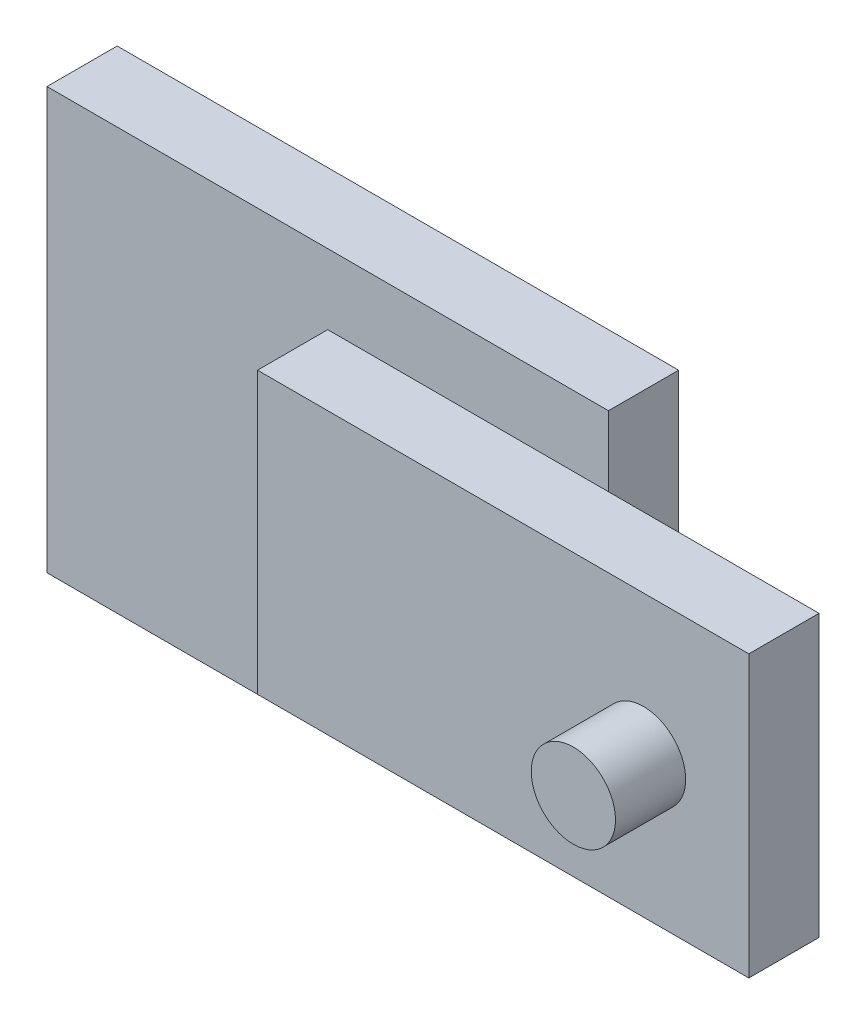
ISO-10303-21;
HEADER;
FILE_DESCRIPTION(('STEP AP214'),'2;1');
FILE_NAME('part.step','',(''),(''),'','','');
FILE_SCHEMA(('AUTOMOTIVE_DESIGN { 1 0 10303 214 1 1 1 1 }'));
ENDSEC;
DATA;
#1=APPLICATION_CONTEXT('core data for automotive mechanical design processes');
#2=APPLICATION_PROTOCOL_DEFINITION('international standard','automotive_design',2000,#1);
#3=PRODUCT_CONTEXT('',#1,'mechanical');
#4=PRODUCT('Part','Part','',(#3));
#5=PRODUCT_RELATED_PRODUCT_CATEGORY('part','',(#4));
#6=PRODUCT_DEFINITION_FORMATION('','',#4);
#7=PRODUCT_DEFINITION_CONTEXT('part definition',#1,'design');
#8=PRODUCT_DEFINITION('design','',#6,#7);
#9=PRODUCT_DEFINITION_SHAPE('','',#8);
#10=(LENGTH_UNIT() NAMED_UNIT(*) SI_UNIT(.MILLI.,.METRE.));
#11=(NAMED_UNIT(*) PLANE_ANGLE_UNIT() SI_UNIT($,.RADIAN.));
#12=(NAMED_UNIT(*) SI_UNIT($,.STERADIAN.) SOLID_ANGLE_UNIT());
#13=UNCERTAINTY_MEASURE_WITH_UNIT(LENGTH_MEASURE(1.E-05),#10,'distance_accuracy_value','');
#14=(GEOMETRIC_REPRESENTATION_CONTEXT(3) GLOBAL_UNCERTAINTY_ASSIGNED_CONTEXT((#13)) GLOBAL_UNIT_ASSIGNED_CONTEXT((#10,
#11,#12)) REPRESENTATION_CONTEXT('',''));
#15=CARTESIAN_POINT('',(0.,0.,0.));
#16=DIRECTION('',(0.,0.,1.));
#17=DIRECTION('',(1.,0.,0.));
#18=AXIS2_PLACEMENT_3D('',#15,#16,#17);
#19=CARTESIAN_POINT('',(0.,0.,10.));
#20=DIRECTION('',(0.,0.,-1.));
#21=DIRECTION('',(-1.,0.,0.));
#22=AXIS2_PLACEMENT_3D('',#19,#20,#21);
#23=PLANE('',#22);
#24=DIRECTION('',(-1.,0.,0.));
#25=VECTOR('',#24,1.);
#26=CARTESIAN_POINT('',(0.,20.,10.));
#27=LINE('',#26,#25);
#28=CARTESIAN_POINT('',(40.,20.,10.));
#29=VERTEX_POINT('',#28);
#30=CARTESIAN_POINT('',(0.,20.,10.));
#31=VERTEX_POINT('',#30);
#32=EDGE_CURVE('E40',#29,#31,#27,.T.);
#33=ORIENTED_EDGE('',*,*,#32,.F.);
#34=DIRECTION('',(0.,1.,0.));
#35=VECTOR('',#34,1.);
#36=CARTESIAN_POINT('',(40.,-30.,10.));
#37=LINE('',#36,#35);
#38=CARTESIAN_POINT('',(40.,30.,10.));
#39=VERTEX_POINT('',#38);
#40=EDGE_CURVE('E137',#29,#39,#37,.T.);
#41=ORIENTED_EDGE('',*,*,#40,.T.);
#42=DIRECTION('',(-1.,0.,0.));
#43=VECTOR('',#42,1.);
#44=CARTESIAN_POINT('',(-40.,30.,10.));
#45=LINE('',#44,#43);
#46=CARTESIAN_POINT('',(-40.,30.,10.));
#47=VERTEX_POINT('',#46);
#48=EDGE_CURVE('E135',#39,#47,#45,.T.);
#49=ORIENTED_EDGE('',*,*,#48,.T.);
#50=DIRECTION('',(0.,-1.,0.));
#51=VECTOR('',#50,1.);
#52=CARTESIAN_POINT('',(-40.,-30.,10.));
#53=LINE('',#52,#51);
#54=CARTESIAN_POINT('',(-40.,-30.,10.));
#55=VERTEX_POINT('',#54);
#56=EDGE_CURVE('E139',#47,#55,#53,.T.);
#57=ORIENTED_EDGE('',*,*,#56,.T.);
#58=DIRECTION('',(1.,0.,0.));
#59=VECTOR('',#58,1.);
#60=CARTESIAN_POINT('',(-40.,-30.,10.));
#61=LINE('',#60,#59);
#62=CARTESIAN_POINT('',(40.,-30.,10.));
#63=VERTEX_POINT('',#62);
#64=EDGE_CURVE('E141',#55,#63,#61,.T.);
#65=ORIENTED_EDGE('',*,*,#64,.T.);
#66=CARTESIAN_POINT('',(40.,-20.,10.));
#67=VERTEX_POINT('',#66);
#68=EDGE_CURVE('E132',#63,#67,#37,.T.);
#69=ORIENTED_EDGE('',*,*,#68,.T.);
#70=DIRECTION('',(1.,0.,0.));
#71=VECTOR('',#70,1.);
#72=CARTESIAN_POINT('',(0.,-20.,10.));
#73=LINE('',#72,#71);
#74=CARTESIAN_POINT('',(0.,-20.,10.));
#75=VERTEX_POINT('',#74);
#76=EDGE_CURVE('E178',#75,#67,#73,.T.);
#77=ORIENTED_EDGE('',*,*,#76,.F.);
#78=DIRECTION('',(0.,-1.,0.));
#79=VECTOR('',#78,1.);
#80=CARTESIAN_POINT('',(0.,-20.,10.));
#81=LINE('',#80,#79);
#82=EDGE_CURVE('E47',#31,#75,#81,.T.);
#83=ORIENTED_EDGE('',*,*,#82,.F.);
#84=EDGE_LOOP('',(#33,#41,#49,#57,#65,#69,#77,#83));
#85=FACE_BOUND('',#84,.T.);
#86=ADVANCED_FACE('F32',(#85),#23,.F.);
#87=CARTESIAN_POINT('',(40.,-30.,10.));
#88=DIRECTION('',(-1.,0.,0.));
#89=DIRECTION('',(0.,0.,1.));
#90=AXIS2_PLACEMENT_3D('',#87,#88,#89);
#91=PLANE('',#90);
#92=DIRECTION('',(0.,1.,0.));
#93=VECTOR('',#92,1.);
#94=CARTESIAN_POINT('',(40.,-30.,0.));
#95=LINE('',#94,#93);
#96=CARTESIAN_POINT('',(40.,-30.,0.));
#97=VERTEX_POINT('',#96);
#98=CARTESIAN_POINT('',(40.,30.,0.));
#99=VERTEX_POINT('',#98);
#100=EDGE_CURVE('E123',#97,#99,#95,.T.);
#101=ORIENTED_EDGE('',*,*,#100,.T.);
#102=DIRECTION('',(0.,0.,-1.));
#103=VECTOR('',#102,1.);
#104=CARTESIAN_POINT('',(40.,30.,10.));
#105=LINE('',#104,#103);
#106=EDGE_CURVE('E156',#39,#99,#105,.T.);
#107=ORIENTED_EDGE('',*,*,#106,.F.);
#108=ORIENTED_EDGE('',*,*,#40,.F.);
#109=EDGE_CURVE('E136',#67,#29,#37,.T.);
#110=ORIENTED_EDGE('',*,*,#109,.F.);
#111=ORIENTED_EDGE('',*,*,#68,.F.);
#112=DIRECTION('',(0.,0.,-1.));
#113=VECTOR('',#112,1.);
#114=CARTESIAN_POINT('',(40.,-30.,10.));
#115=LINE('',#114,#113);
#116=EDGE_CURVE('E142',#63,#97,#115,.T.);
#117=ORIENTED_EDGE('',*,*,#116,.T.);
#118=EDGE_LOOP('',(#101,#107,#108,#110,#111,#117));
#119=FACE_BOUND('',#118,.T.);
#120=ADVANCED_FACE('F34',(#119),#91,.F.);
#121=CARTESIAN_POINT('',(-40.,30.,10.));
#122=DIRECTION('',(0.,-1.,0.));
#123=DIRECTION('',(0.,0.,-1.));
#124=AXIS2_PLACEMENT_3D('',#121,#122,#123);
#125=PLANE('',#124);
#126=DIRECTION('',(-1.,0.,0.));
#127=VECTOR('',#126,1.);
#128=CARTESIAN_POINT('',(-40.,30.,0.));
#129=LINE('',#128,#127);
#130=CARTESIAN_POINT('',(-40.,30.,0.));
#131=VERTEX_POINT('',#130);
#132=EDGE_CURVE('E126',#99,#131,#129,.T.);
#133=ORIENTED_EDGE('',*,*,#132,.T.);
#134=DIRECTION('',(0.,0.,-1.));
#135=VECTOR('',#134,1.);
#136=CARTESIAN_POINT('',(-40.,30.,10.));
#137=LINE('',#136,#135);
#138=EDGE_CURVE('E154',#47,#131,#137,.T.);
#139=ORIENTED_EDGE('',*,*,#138,.F.);
#140=ORIENTED_EDGE('',*,*,#48,.F.);
#141=ORIENTED_EDGE('',*,*,#106,.T.);
#142=EDGE_LOOP('',(#133,#139,#140,#141));
#143=FACE_BOUND('',#142,.T.);
#144=ADVANCED_FACE('F193',(#143),#125,.F.);
#145=CARTESIAN_POINT('',(-40.,-30.,10.));
#146=DIRECTION('',(1.,0.,0.));
#147=DIRECTION('',(0.,0.,-1.));
#148=AXIS2_PLACEMENT_3D('',#145,#146,#147);
#149=PLANE('',#148);
#150=DIRECTION('',(0.,-1.,0.));
#151=VECTOR('',#150,1.);
#152=CARTESIAN_POINT('',(-40.,-30.,0.));
#153=LINE('',#152,#151);
#154=CARTESIAN_POINT('',(-40.,-30.,0.));
#155=VERTEX_POINT('',#154);
#156=EDGE_CURVE('E145',#131,#155,#153,.T.);
#157=ORIENTED_EDGE('',*,*,#156,.T.);
#158=DIRECTION('',(0.,0.,-1.));
#159=VECTOR('',#158,1.);
#160=CARTESIAN_POINT('',(-40.,-30.,10.));
#161=LINE('',#160,#159);
#162=EDGE_CURVE('E151',#55,#155,#161,.T.);
#163=ORIENTED_EDGE('',*,*,#162,.F.);
#164=ORIENTED_EDGE('',*,*,#56,.F.);
#165=ORIENTED_EDGE('',*,*,#138,.T.);
#166=EDGE_LOOP('',(#157,#163,#164,#165));
#167=FACE_BOUND('',#166,.T.);
#168=ADVANCED_FACE('F202',(#167),#149,.F.);
#169=CARTESIAN_POINT('',(-40.,-30.,10.));
#170=DIRECTION('',(0.,1.,0.));
#171=DIRECTION('',(0.,0.,1.));
#172=AXIS2_PLACEMENT_3D('',#169,#170,#171);
#173=PLANE('',#172);
#174=DIRECTION('',(1.,0.,0.));
#175=VECTOR('',#174,1.);
#176=CARTESIAN_POINT('',(-40.,-30.,0.));
#177=LINE('',#176,#175);
#178=EDGE_CURVE('E147',#155,#97,#177,.T.);
#179=ORIENTED_EDGE('',*,*,#178,.T.);
#180=ORIENTED_EDGE('',*,*,#116,.F.);
#181=ORIENTED_EDGE('',*,*,#64,.F.);
#182=ORIENTED_EDGE('',*,*,#162,.T.);
#183=EDGE_LOOP('',(#179,#180,#181,#182));
#184=FACE_BOUND('',#183,.T.);
#185=ADVANCED_FACE('F206',(#184),#173,.F.);
#186=CARTESIAN_POINT('',(0.,0.,0.));
#187=DIRECTION('',(0.,0.,-1.));
#188=DIRECTION('',(-1.,0.,0.));
#189=AXIS2_PLACEMENT_3D('',#186,#187,#188);
#190=PLANE('',#189);
#191=ORIENTED_EDGE('',*,*,#100,.F.);
#192=ORIENTED_EDGE('',*,*,#178,.F.);
#193=ORIENTED_EDGE('',*,*,#156,.F.);
#194=ORIENTED_EDGE('',*,*,#132,.F.);
#195=EDGE_LOOP('',(#191,#192,#193,#194));
#196=FACE_BOUND('',#195,.T.);
#197=ADVANCED_FACE('F199',(#196),#190,.T.);
#198=CARTESIAN_POINT('',(0.,20.,20.));
#199=DIRECTION('',(0.,-1.,0.));
#200=DIRECTION('',(0.,0.,-1.));
#201=AXIS2_PLACEMENT_3D('',#198,#199,#200);
#202=PLANE('',#201);
#203=CARTESIAN_POINT('',(70.,20.,10.));
#204=VERTEX_POINT('',#203);
#205=EDGE_CURVE('E162',#204,#29,#27,.T.);
#206=ORIENTED_EDGE('',*,*,#205,.T.);
#207=ORIENTED_EDGE('',*,*,#32,.T.);
#208=DIRECTION('',(0.,0.,-1.));
#209=VECTOR('',#208,1.);
#210=CARTESIAN_POINT('',(0.,20.,20.));
#211=LINE('',#210,#209);
#212=CARTESIAN_POINT('',(0.,20.,20.));
#213=VERTEX_POINT('',#212);
#214=EDGE_CURVE('E104',#213,#31,#211,.T.);
#215=ORIENTED_EDGE('',*,*,#214,.F.);
#216=DIRECTION('',(-1.,0.,0.));
#217=VECTOR('',#216,1.);
#218=CARTESIAN_POINT('',(0.,20.,20.));
#219=LINE('',#218,#217);
#220=CARTESIAN_POINT('',(70.,20.,20.));
#221=VERTEX_POINT('',#220);
#222=EDGE_CURVE('E110',#221,#213,#219,.T.);
#223=ORIENTED_EDGE('',*,*,#222,.F.);
#224=DIRECTION('',(0.,0.,-1.));
#225=VECTOR('',#224,1.);
#226=CARTESIAN_POINT('',(70.,20.,20.));
#227=LINE('',#226,#225);
#228=EDGE_CURVE('E173',#221,#204,#227,.T.);
#229=ORIENTED_EDGE('',*,*,#228,.T.);
#230=EDGE_LOOP('',(#206,#207,#215,#223,#229));
#231=FACE_BOUND('',#230,.T.);
#232=ADVANCED_FACE('F122',(#231),#202,.F.);
#233=CARTESIAN_POINT('',(0.,-20.,20.));
#234=DIRECTION('',(1.,0.,0.));
#235=DIRECTION('',(0.,0.,-1.));
#236=AXIS2_PLACEMENT_3D('',#233,#234,#235);
#237=PLANE('',#236);
#238=ORIENTED_EDGE('',*,*,#82,.T.);
#239=DIRECTION('',(0.,0.,-1.));
#240=VECTOR('',#239,1.);
#241=CARTESIAN_POINT('',(0.,-20.,20.));
#242=LINE('',#241,#240);
#243=CARTESIAN_POINT('',(0.,-20.,20.));
#244=VERTEX_POINT('',#243);
#245=EDGE_CURVE('E106',#244,#75,#242,.T.);
#246=ORIENTED_EDGE('',*,*,#245,.F.);
#247=DIRECTION('',(0.,-1.,0.));
#248=VECTOR('',#247,1.);
#249=CARTESIAN_POINT('',(0.,-20.,20.));
#250=LINE('',#249,#248);
#251=EDGE_CURVE('E100',#213,#244,#250,.T.);
#252=ORIENTED_EDGE('',*,*,#251,.F.);
#253=ORIENTED_EDGE('',*,*,#214,.T.);
#254=EDGE_LOOP('',(#238,#246,#252,#253));
#255=FACE_BOUND('',#254,.T.);
#256=ADVANCED_FACE('F102',(#255),#237,.F.);
#257=CARTESIAN_POINT('',(0.,-20.,20.));
#258=DIRECTION('',(0.,1.,0.));
#259=DIRECTION('',(0.,0.,1.));
#260=AXIS2_PLACEMENT_3D('',#257,#258,#259);
#261=PLANE('',#260);
#262=ORIENTED_EDGE('',*,*,#76,.T.);
#263=CARTESIAN_POINT('',(70.,-20.,10.));
#264=VERTEX_POINT('',#263);
#265=EDGE_CURVE('E167',#67,#264,#73,.T.);
#266=ORIENTED_EDGE('',*,*,#265,.T.);
#267=DIRECTION('',(0.,0.,-1.));
#268=VECTOR('',#267,1.);
#269=CARTESIAN_POINT('',(70.,-20.,20.));
#270=LINE('',#269,#268);
#271=CARTESIAN_POINT('',(70.,-20.,20.));
#272=VERTEX_POINT('',#271);
#273=EDGE_CURVE('E128',#272,#264,#270,.T.);
#274=ORIENTED_EDGE('',*,*,#273,.F.);
#275=DIRECTION('',(1.,0.,0.));
#276=VECTOR('',#275,1.);
#277=CARTESIAN_POINT('',(0.,-20.,20.));
#278=LINE('',#277,#276);
#279=EDGE_CURVE('E109',#244,#272,#278,.T.);
#280=ORIENTED_EDGE('',*,*,#279,.F.);
#281=ORIENTED_EDGE('',*,*,#245,.T.);
#282=EDGE_LOOP('',(#262,#266,#274,#280,#281));
#283=FACE_BOUND('',#282,.T.);
#284=ADVANCED_FACE('F183',(#283),#261,.F.);
#285=CARTESIAN_POINT('',(70.,20.,20.));
#286=DIRECTION('',(-1.,0.,0.));
#287=DIRECTION('',(0.,0.,1.));
#288=AXIS2_PLACEMENT_3D('',#285,#286,#287);
#289=PLANE('',#288);
#290=DIRECTION('',(0.,1.,0.));
#291=VECTOR('',#290,1.);
#292=CARTESIAN_POINT('',(70.,20.,10.));
#293=LINE('',#292,#291);
#294=EDGE_CURVE('E119',#264,#204,#293,.T.);
#295=ORIENTED_EDGE('',*,*,#294,.T.);
#296=ORIENTED_EDGE('',*,*,#228,.F.);
#297=DIRECTION('',(0.,1.,0.));
#298=VECTOR('',#297,1.);
#299=CARTESIAN_POINT('',(70.,20.,20.));
#300=LINE('',#299,#298);
#301=EDGE_CURVE('E115',#272,#221,#300,.T.);
#302=ORIENTED_EDGE('',*,*,#301,.F.);
#303=ORIENTED_EDGE('',*,*,#273,.T.);
#304=EDGE_LOOP('',(#295,#296,#302,#303));
#305=FACE_BOUND('',#304,.T.);
#306=ADVANCED_FACE('F188',(#305),#289,.F.);
#307=CARTESIAN_POINT('',(0.,0.,20.));
#308=DIRECTION('',(0.,0.,-1.));
#309=DIRECTION('',(-1.,0.,0.));
#310=AXIS2_PLACEMENT_3D('',#307,#308,#309);
#311=PLANE('',#310);
#312=CARTESIAN_POINT('',(55.,0.,20.));
#313=DIRECTION('',(0.,0.,-1.));
#314=DIRECTION('',(-1.,0.,0.));
#315=AXIS2_PLACEMENT_3D('',#312,#313,#314);
#316=CIRCLE('',#315,6.);
#317=CARTESIAN_POINT('',(49.,0.,20.));
#318=VERTEX_POINT('',#317);
#319=EDGE_CURVE('E11',#318,#318,#316,.F.);
#320=ORIENTED_EDGE('',*,*,#319,.F.);
#321=EDGE_LOOP('',(#320));
#322=FACE_BOUND('',#321,.T.);
#323=ORIENTED_EDGE('',*,*,#222,.T.);
#324=ORIENTED_EDGE('',*,*,#251,.T.);
#325=ORIENTED_EDGE('',*,*,#279,.T.);
#326=ORIENTED_EDGE('',*,*,#301,.T.);
#327=EDGE_LOOP('',(#323,#324,#325,#326));
#328=FACE_BOUND('',#327,.T.);
#329=ADVANCED_FACE('F113',(#322,#328),#311,.F.);
#330=CARTESIAN_POINT('',(0.,0.,10.));
#331=DIRECTION('',(0.,0.,-1.));
#332=DIRECTION('',(-1.,0.,0.));
#333=AXIS2_PLACEMENT_3D('',#330,#331,#332);
#334=PLANE('',#333);
#335=ORIENTED_EDGE('',*,*,#265,.F.);
#336=ORIENTED_EDGE('',*,*,#109,.T.);
#337=ORIENTED_EDGE('',*,*,#205,.F.);
#338=ORIENTED_EDGE('',*,*,#294,.F.);
#339=EDGE_LOOP('',(#335,#336,#337,#338));
#340=FACE_BOUND('',#339,.T.);
#341=ADVANCED_FACE('F189',(#340),#334,.T.);
#342=CARTESIAN_POINT('',(55.,0.,30.));
#343=DIRECTION('',(0.,0.,-1.));
#344=DIRECTION('',(-1.,0.,0.));
#345=AXIS2_PLACEMENT_3D('',#342,#343,#344);
#346=CYLINDRICAL_SURFACE('',#345,6.);
#347=CARTESIAN_POINT('',(55.,0.,30.));
#348=DIRECTION('',(0.,0.,1.));
#349=DIRECTION('',(1.,0.,0.));
#350=AXIS2_PLACEMENT_3D('',#347,#348,#349);
#351=CIRCLE('',#350,6.);
#352=CARTESIAN_POINT('',(61.,0.,30.));
#353=VERTEX_POINT('',#352);
#354=EDGE_CURVE('E165',#353,#353,#351,.T.);
#355=ORIENTED_EDGE('',*,*,#354,.F.);
#356=EDGE_LOOP('',(#355));
#357=FACE_BOUND('',#356,.T.);
#358=ORIENTED_EDGE('',*,*,#319,.T.);
#359=EDGE_LOOP('',(#358));
#360=FACE_BOUND('',#359,.T.);
#361=ADVANCED_FACE('F231',(#357,#360),#346,.T.);
#362=CARTESIAN_POINT('',(55.,0.,30.));
#363=DIRECTION('',(0.,0.,1.));
#364=DIRECTION('',(1.,0.,0.));
#365=AXIS2_PLACEMENT_3D('',#362,#363,#364);
#366=PLANE('',#365);
#367=ORIENTED_EDGE('',*,*,#354,.T.);
#368=EDGE_LOOP('',(#367));
#369=FACE_BOUND('',#368,.T.);
#370=ADVANCED_FACE('F237',(#369),#366,.T.);
#371=CLOSED_SHELL('',(#86,#120,#144,#168,#185,#197,#232,#256,#284,#306,#329,#341,#361,#370));
#372=MANIFOLD_SOLID_BREP('B2',#371);
#373=ADVANCED_BREP_SHAPE_REPRESENTATION('',(#18,#372),#14);
#374=SHAPE_DEFINITION_REPRESENTATION(#9,#373);
ENDSEC;
END-ISO-10303-21;
